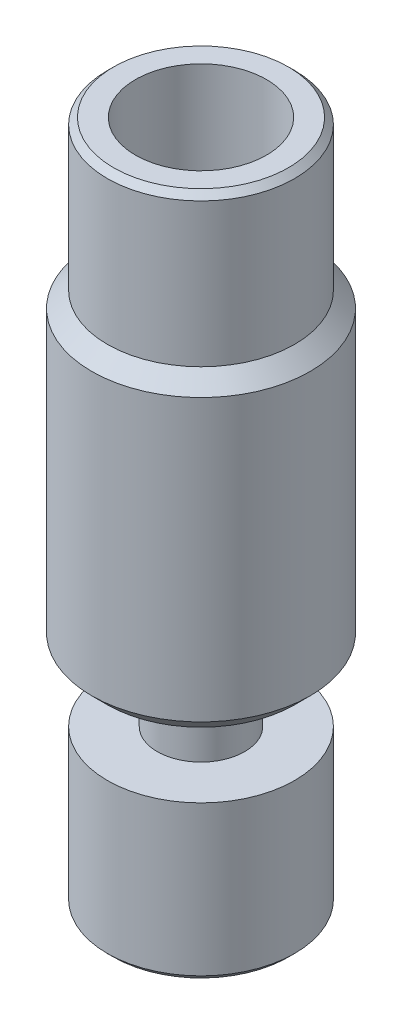
ISO-10303-21;
HEADER;
FILE_DESCRIPTION(('STEP AP214'),'2;1');
FILE_NAME('part.step','',(''),(''),'','','');
FILE_SCHEMA(('AUTOMOTIVE_DESIGN { 1 0 10303 214 1 1 1 1 }'));
ENDSEC;
DATA;
#1=APPLICATION_CONTEXT('core data for automotive mechanical design processes');
#2=APPLICATION_PROTOCOL_DEFINITION('international standard','automotive_design',2000,#1);
#3=PRODUCT_CONTEXT('',#1,'mechanical');
#4=PRODUCT('Part','Part','',(#3));
#5=PRODUCT_RELATED_PRODUCT_CATEGORY('part','',(#4));
#6=PRODUCT_DEFINITION_FORMATION('','',#4);
#7=PRODUCT_DEFINITION_CONTEXT('part definition',#1,'design');
#8=PRODUCT_DEFINITION('design','',#6,#7);
#9=PRODUCT_DEFINITION_SHAPE('','',#8);
#10=(LENGTH_UNIT() NAMED_UNIT(*) SI_UNIT(.MILLI.,.METRE.));
#11=(NAMED_UNIT(*) PLANE_ANGLE_UNIT() SI_UNIT($,.RADIAN.));
#12=(NAMED_UNIT(*) SI_UNIT($,.STERADIAN.) SOLID_ANGLE_UNIT());
#13=UNCERTAINTY_MEASURE_WITH_UNIT(LENGTH_MEASURE(1.E-05),#10,'distance_accuracy_value','');
#14=(GEOMETRIC_REPRESENTATION_CONTEXT(3) GLOBAL_UNCERTAINTY_ASSIGNED_CONTEXT((#13)) GLOBAL_UNIT_ASSIGNED_CONTEXT((#10,
#11,#12)) REPRESENTATION_CONTEXT('',''));
#15=CARTESIAN_POINT('',(0.,0.,0.));
#16=DIRECTION('',(0.,0.,1.));
#17=DIRECTION('',(1.,0.,0.));
#18=AXIS2_PLACEMENT_3D('',#15,#16,#17);
#19=CARTESIAN_POINT('',(0.,21.9,3.));
#20=DIRECTION('',(0.,-1.,0.));
#21=DIRECTION('',(0.,0.,-1.));
#22=AXIS2_PLACEMENT_3D('',#19,#20,#21);
#23=PLANE('',#22);
#24=CARTESIAN_POINT('',(0.,21.9,0.));
#25=DIRECTION('',(0.,-1.,0.));
#26=DIRECTION('',(0.,0.,-1.));
#27=AXIS2_PLACEMENT_3D('',#24,#25,#26);
#28=CIRCLE('',#27,2.8);
#29=CARTESIAN_POINT('',(0.,21.9,-2.8));
#30=VERTEX_POINT('',#29);
#31=EDGE_CURVE('E47',#30,#30,#28,.F.);
#32=ORIENTED_EDGE('',*,*,#31,.T.);
#33=EDGE_LOOP('',(#32));
#34=FACE_BOUND('',#33,.T.);
#35=CARTESIAN_POINT('',(0.,21.9,0.));
#36=DIRECTION('',(0.,1.,0.));
#37=DIRECTION('',(0.,0.,1.));
#38=AXIS2_PLACEMENT_3D('',#35,#36,#37);
#39=CIRCLE('',#38,2.1);
#40=CARTESIAN_POINT('',(0.,21.9,2.1));
#41=VERTEX_POINT('',#40);
#42=EDGE_CURVE('E82',#41,#41,#39,.T.);
#43=ORIENTED_EDGE('',*,*,#42,.F.);
#44=EDGE_LOOP('',(#43));
#45=FACE_BOUND('',#44,.T.);
#46=ADVANCED_FACE('F32',(#34,#45),#23,.F.);
#47=CARTESIAN_POINT('',(0.,0.,0.));
#48=DIRECTION('',(0.,-1.,0.));
#49=DIRECTION('',(0.,0.,-1.));
#50=AXIS2_PLACEMENT_3D('',#47,#48,#49);
#51=CYLINDRICAL_SURFACE('',#50,0.999999999999995);
#52=CARTESIAN_POINT('',(0.,16.4390533190697,0.));
#53=DIRECTION('',(0.,1.,0.));
#54=DIRECTION('',(0.,0.,1.));
#55=AXIS2_PLACEMENT_3D('',#52,#53,#54);
#56=CIRCLE('',#55,0.999999999999995);
#57=CARTESIAN_POINT('',(0.,16.4390533190697,0.999999999999995));
#58=VERTEX_POINT('',#57);
#59=EDGE_CURVE('E62',#58,#58,#56,.T.);
#60=ORIENTED_EDGE('',*,*,#59,.T.);
#61=EDGE_LOOP('',(#60));
#62=FACE_BOUND('',#61,.T.);
#63=CARTESIAN_POINT('',(0.,0.,0.));
#64=DIRECTION('',(0.,-1.,0.));
#65=DIRECTION('',(0.,0.,-1.));
#66=AXIS2_PLACEMENT_3D('',#63,#64,#65);
#67=CIRCLE('',#66,0.99999999999999);
#68=CARTESIAN_POINT('',(0.,0.,-0.99999999999999));
#69=VERTEX_POINT('',#68);
#70=EDGE_CURVE('E61',#69,#69,#67,.T.);
#71=ORIENTED_EDGE('',*,*,#70,.T.);
#72=EDGE_LOOP('',(#71));
#73=FACE_BOUND('',#72,.T.);
#74=ADVANCED_FACE('F89',(#62,#73),#51,.F.);
#75=CARTESIAN_POINT('',(0.,0.,0.99999999999999));
#76=DIRECTION('',(0.,1.,0.));
#77=DIRECTION('',(0.,0.,1.));
#78=AXIS2_PLACEMENT_3D('',#75,#76,#77);
#79=PLANE('',#78);
#80=CARTESIAN_POINT('',(0.,0.,0.));
#81=DIRECTION('',(0.,1.,0.));
#82=DIRECTION('',(0.,0.,1.));
#83=AXIS2_PLACEMENT_3D('',#80,#81,#82);
#84=CIRCLE('',#83,2.8);
#85=CARTESIAN_POINT('',(0.,0.,2.8));
#86=VERTEX_POINT('',#85);
#87=EDGE_CURVE('E58',#86,#86,#84,.F.);
#88=ORIENTED_EDGE('',*,*,#87,.T.);
#89=EDGE_LOOP('',(#88));
#90=FACE_BOUND('',#89,.T.);
#91=ORIENTED_EDGE('',*,*,#70,.F.);
#92=EDGE_LOOP('',(#91));
#93=FACE_BOUND('',#92,.T.);
#94=ADVANCED_FACE('F95',(#90,#93),#79,.F.);
#95=CARTESIAN_POINT('',(0.,0.,0.));
#96=DIRECTION('',(0.,-1.,0.));
#97=DIRECTION('',(0.,0.,-1.));
#98=AXIS2_PLACEMENT_3D('',#95,#96,#97);
#99=CYLINDRICAL_SURFACE('',#98,3.);
#100=CARTESIAN_POINT('',(0.,0.200000000000001,0.));
#101=DIRECTION('',(0.,1.,0.));
#102=DIRECTION('',(0.,0.,1.));
#103=AXIS2_PLACEMENT_3D('',#100,#101,#102);
#104=CIRCLE('',#103,3.);
#105=CARTESIAN_POINT('',(0.,0.200000000000001,3.));
#106=VERTEX_POINT('',#105);
#107=EDGE_CURVE('E55',#106,#106,#104,.T.);
#108=ORIENTED_EDGE('',*,*,#107,.T.);
#109=EDGE_LOOP('',(#108));
#110=FACE_BOUND('',#109,.T.);
#111=CARTESIAN_POINT('',(0.,5.,0.));
#112=DIRECTION('',(0.,-1.,0.));
#113=DIRECTION('',(0.,0.,-1.));
#114=AXIS2_PLACEMENT_3D('',#111,#112,#113);
#115=CIRCLE('',#114,3.);
#116=CARTESIAN_POINT('',(0.,5.,-3.));
#117=VERTEX_POINT('',#116);
#118=EDGE_CURVE('E69',#117,#117,#115,.T.);
#119=ORIENTED_EDGE('',*,*,#118,.T.);
#120=EDGE_LOOP('',(#119));
#121=FACE_BOUND('',#120,.T.);
#122=ADVANCED_FACE('F132',(#110,#121),#99,.T.);
#123=CARTESIAN_POINT('',(0.,5.,3.));
#124=DIRECTION('',(0.,-1.,0.));
#125=DIRECTION('',(0.,0.,-1.));
#126=AXIS2_PLACEMENT_3D('',#123,#124,#125);
#127=PLANE('',#126);
#128=ORIENTED_EDGE('',*,*,#118,.F.);
#129=EDGE_LOOP('',(#128));
#130=FACE_BOUND('',#129,.T.);
#131=CARTESIAN_POINT('',(0.,5.,0.));
#132=DIRECTION('',(0.,-1.,0.));
#133=DIRECTION('',(0.,0.,-1.));
#134=AXIS2_PLACEMENT_3D('',#131,#132,#133);
#135=CIRCLE('',#134,1.4);
#136=CARTESIAN_POINT('',(0.,5.,-1.4));
#137=VERTEX_POINT('',#136);
#138=EDGE_CURVE('E72',#137,#137,#135,.T.);
#139=ORIENTED_EDGE('',*,*,#138,.T.);
#140=EDGE_LOOP('',(#139));
#141=FACE_BOUND('',#140,.T.);
#142=ADVANCED_FACE('F126',(#130,#141),#127,.F.);
#143=CARTESIAN_POINT('',(0.,0.,0.));
#144=DIRECTION('',(0.,-1.,0.));
#145=DIRECTION('',(0.,0.,-1.));
#146=AXIS2_PLACEMENT_3D('',#143,#144,#145);
#147=CYLINDRICAL_SURFACE('',#146,1.4);
#148=ORIENTED_EDGE('',*,*,#138,.F.);
#149=EDGE_LOOP('',(#148));
#150=FACE_BOUND('',#149,.T.);
#151=CARTESIAN_POINT('',(0.,7.1,0.));
#152=DIRECTION('',(0.,-1.,0.));
#153=DIRECTION('',(0.,0.,-1.));
#154=AXIS2_PLACEMENT_3D('',#151,#152,#153);
#155=CIRCLE('',#154,1.4);
#156=CARTESIAN_POINT('',(0.,7.1,-1.4));
#157=VERTEX_POINT('',#156);
#158=EDGE_CURVE('E75',#157,#157,#155,.T.);
#159=ORIENTED_EDGE('',*,*,#158,.T.);
#160=EDGE_LOOP('',(#159));
#161=FACE_BOUND('',#160,.T.);
#162=ADVANCED_FACE('F121',(#150,#161),#147,.T.);
#163=CARTESIAN_POINT('',(0.,7.1,1.4));
#164=DIRECTION('',(0.,1.,0.));
#165=DIRECTION('',(0.,0.,1.));
#166=AXIS2_PLACEMENT_3D('',#163,#164,#165);
#167=PLANE('',#166);
#168=CARTESIAN_POINT('',(0.,7.1,0.));
#169=DIRECTION('',(0.,1.,0.));
#170=DIRECTION('',(0.,0.,1.));
#171=AXIS2_PLACEMENT_3D('',#168,#169,#170);
#172=CIRCLE('',#171,3.);
#173=CARTESIAN_POINT('',(0.,7.1,3.));
#174=VERTEX_POINT('',#173);
#175=EDGE_CURVE('E43',#174,#174,#172,.F.);
#176=ORIENTED_EDGE('',*,*,#175,.T.);
#177=EDGE_LOOP('',(#176));
#178=FACE_BOUND('',#177,.T.);
#179=ORIENTED_EDGE('',*,*,#158,.F.);
#180=EDGE_LOOP('',(#179));
#181=FACE_BOUND('',#180,.T.);
#182=ADVANCED_FACE('F117',(#178,#181),#167,.F.);
#183=CARTESIAN_POINT('',(0.,0.,0.));
#184=DIRECTION('',(0.,-1.,0.));
#185=DIRECTION('',(0.,0.,-1.));
#186=AXIS2_PLACEMENT_3D('',#183,#184,#185);
#187=CYLINDRICAL_SURFACE('',#186,3.5);
#188=CARTESIAN_POINT('',(0.,7.6,0.));
#189=DIRECTION('',(0.,1.,0.));
#190=DIRECTION('',(0.,0.,1.));
#191=AXIS2_PLACEMENT_3D('',#188,#189,#190);
#192=CIRCLE('',#191,3.5);
#193=CARTESIAN_POINT('',(0.,7.6,3.5));
#194=VERTEX_POINT('',#193);
#195=EDGE_CURVE('E10',#194,#194,#192,.T.);
#196=ORIENTED_EDGE('',*,*,#195,.T.);
#197=EDGE_LOOP('',(#196));
#198=FACE_BOUND('',#197,.T.);
#199=CARTESIAN_POINT('',(0.,16.6,0.));
#200=DIRECTION('',(0.,-1.,0.));
#201=DIRECTION('',(0.,0.,-1.));
#202=AXIS2_PLACEMENT_3D('',#199,#200,#201);
#203=CIRCLE('',#202,3.5);
#204=CARTESIAN_POINT('',(0.,16.6,-3.5));
#205=VERTEX_POINT('',#204);
#206=EDGE_CURVE('E39',#205,#205,#203,.T.);
#207=ORIENTED_EDGE('',*,*,#206,.T.);
#208=EDGE_LOOP('',(#207));
#209=FACE_BOUND('',#208,.T.);
#210=ADVANCED_FACE('F120',(#198,#209),#187,.T.);
#211=CARTESIAN_POINT('',(0.,0.,0.));
#212=DIRECTION('',(0.,-1.,0.));
#213=DIRECTION('',(0.,0.,-1.));
#214=AXIS2_PLACEMENT_3D('',#211,#212,#213);
#215=CYLINDRICAL_SURFACE('',#214,3.);
#216=CARTESIAN_POINT('',(0.,21.7,0.));
#217=DIRECTION('',(0.,-1.,0.));
#218=DIRECTION('',(0.,0.,-1.));
#219=AXIS2_PLACEMENT_3D('',#216,#217,#218);
#220=CIRCLE('',#219,3.);
#221=CARTESIAN_POINT('',(0.,21.7,-3.));
#222=VERTEX_POINT('',#221);
#223=EDGE_CURVE('E52',#222,#222,#220,.T.);
#224=ORIENTED_EDGE('',*,*,#223,.T.);
#225=EDGE_LOOP('',(#224));
#226=FACE_BOUND('',#225,.T.);
#227=CARTESIAN_POINT('',(0.,17.1,0.));
#228=DIRECTION('',(0.,-1.,0.));
#229=DIRECTION('',(0.,0.,-1.));
#230=AXIS2_PLACEMENT_3D('',#227,#228,#229);
#231=CIRCLE('',#230,3.);
#232=CARTESIAN_POINT('',(0.,17.1,-3.));
#233=VERTEX_POINT('',#232);
#234=EDGE_CURVE('E65',#233,#233,#231,.T.);
#235=ORIENTED_EDGE('',*,*,#234,.F.);
#236=EDGE_LOOP('',(#235));
#237=FACE_BOUND('',#236,.T.);
#238=ADVANCED_FACE('F181',(#226,#237),#215,.T.);
#239=CARTESIAN_POINT('',(0.,17.1,0.));
#240=DIRECTION('',(0.,1.,0.));
#241=DIRECTION('',(0.,0.,1.));
#242=AXIS2_PLACEMENT_3D('',#239,#240,#241);
#243=CONICAL_SURFACE('',#242,2.1,1.02974425867666);
#244=CARTESIAN_POINT('',(0.,17.1,0.));
#245=DIRECTION('',(0.,1.,0.));
#246=DIRECTION('',(0.,0.,1.));
#247=AXIS2_PLACEMENT_3D('',#244,#245,#246);
#248=CIRCLE('',#247,2.1);
#249=CARTESIAN_POINT('',(0.,17.1,2.1));
#250=VERTEX_POINT('',#249);
#251=EDGE_CURVE('E66',#250,#250,#248,.T.);
#252=ORIENTED_EDGE('',*,*,#251,.T.);
#253=EDGE_LOOP('',(#252));
#254=FACE_BOUND('',#253,.T.);
#255=ORIENTED_EDGE('',*,*,#59,.F.);
#256=EDGE_LOOP('',(#255));
#257=FACE_BOUND('',#256,.T.);
#258=ADVANCED_FACE('F176',(#254,#257),#243,.F.);
#259=CARTESIAN_POINT('',(0.,21.9,0.));
#260=DIRECTION('',(0.,1.,0.));
#261=DIRECTION('',(0.,0.,1.));
#262=AXIS2_PLACEMENT_3D('',#259,#260,#261);
#263=CYLINDRICAL_SURFACE('',#262,2.1);
#264=ORIENTED_EDGE('',*,*,#251,.F.);
#265=EDGE_LOOP('',(#264));
#266=FACE_BOUND('',#265,.T.);
#267=ORIENTED_EDGE('',*,*,#42,.T.);
#268=EDGE_LOOP('',(#267));
#269=FACE_BOUND('',#268,.T.);
#270=ADVANCED_FACE('F86',(#266,#269),#263,.F.);
#271=CARTESIAN_POINT('',(0.,0.,0.));
#272=DIRECTION('',(0.,1.,0.));
#273=DIRECTION('',(0.,0.,1.));
#274=AXIS2_PLACEMENT_3D('',#271,#272,#273);
#275=CONICAL_SURFACE('',#274,2.8,0.785398163397451);
#276=ORIENTED_EDGE('',*,*,#107,.F.);
#277=EDGE_LOOP('',(#276));
#278=FACE_BOUND('',#277,.T.);
#279=ORIENTED_EDGE('',*,*,#87,.F.);
#280=EDGE_LOOP('',(#279));
#281=FACE_BOUND('',#280,.T.);
#282=ADVANCED_FACE('F100',(#278,#281),#275,.T.);
#283=CARTESIAN_POINT('',(0.,21.7,0.));
#284=DIRECTION('',(0.,-1.,0.));
#285=DIRECTION('',(0.,0.,-1.));
#286=AXIS2_PLACEMENT_3D('',#283,#284,#285);
#287=CONICAL_SURFACE('',#286,3.,0.785398163397452);
#288=ORIENTED_EDGE('',*,*,#31,.F.);
#289=EDGE_LOOP('',(#288));
#290=FACE_BOUND('',#289,.T.);
#291=ORIENTED_EDGE('',*,*,#223,.F.);
#292=EDGE_LOOP('',(#291));
#293=FACE_BOUND('',#292,.T.);
#294=ADVANCED_FACE('F103',(#290,#293),#287,.T.);
#295=CARTESIAN_POINT('',(0.,7.1,0.));
#296=DIRECTION('',(0.,1.,0.));
#297=DIRECTION('',(0.,0.,1.));
#298=AXIS2_PLACEMENT_3D('',#295,#296,#297);
#299=CONICAL_SURFACE('',#298,3.,0.785398163397447);
#300=ORIENTED_EDGE('',*,*,#195,.F.);
#301=EDGE_LOOP('',(#300));
#302=FACE_BOUND('',#301,.T.);
#303=ORIENTED_EDGE('',*,*,#175,.F.);
#304=EDGE_LOOP('',(#303));
#305=FACE_BOUND('',#304,.T.);
#306=ADVANCED_FACE('F106',(#302,#305),#299,.T.);
#307=CARTESIAN_POINT('',(0.,16.6,0.));
#308=DIRECTION('',(0.,-1.,0.));
#309=DIRECTION('',(0.,0.,-1.));
#310=AXIS2_PLACEMENT_3D('',#307,#308,#309);
#311=CONICAL_SURFACE('',#310,3.5,0.78539816339745);
#312=ORIENTED_EDGE('',*,*,#234,.T.);
#313=EDGE_LOOP('',(#312));
#314=FACE_BOUND('',#313,.T.);
#315=ORIENTED_EDGE('',*,*,#206,.F.);
#316=EDGE_LOOP('',(#315));
#317=FACE_BOUND('',#316,.T.);
#318=ADVANCED_FACE('F34',(#314,#317),#311,.T.);
#319=CLOSED_SHELL('',(#46,#74,#94,#122,#142,#162,#182,#210,#238,#258,#270,#282,#294,#306,#318));
#320=MANIFOLD_SOLID_BREP('B2',#319);
#321=ADVANCED_BREP_SHAPE_REPRESENTATION('',(#18,#320),#14);
#322=SHAPE_DEFINITION_REPRESENTATION(#9,#321);
ENDSEC;
END-ISO-10303-21;
